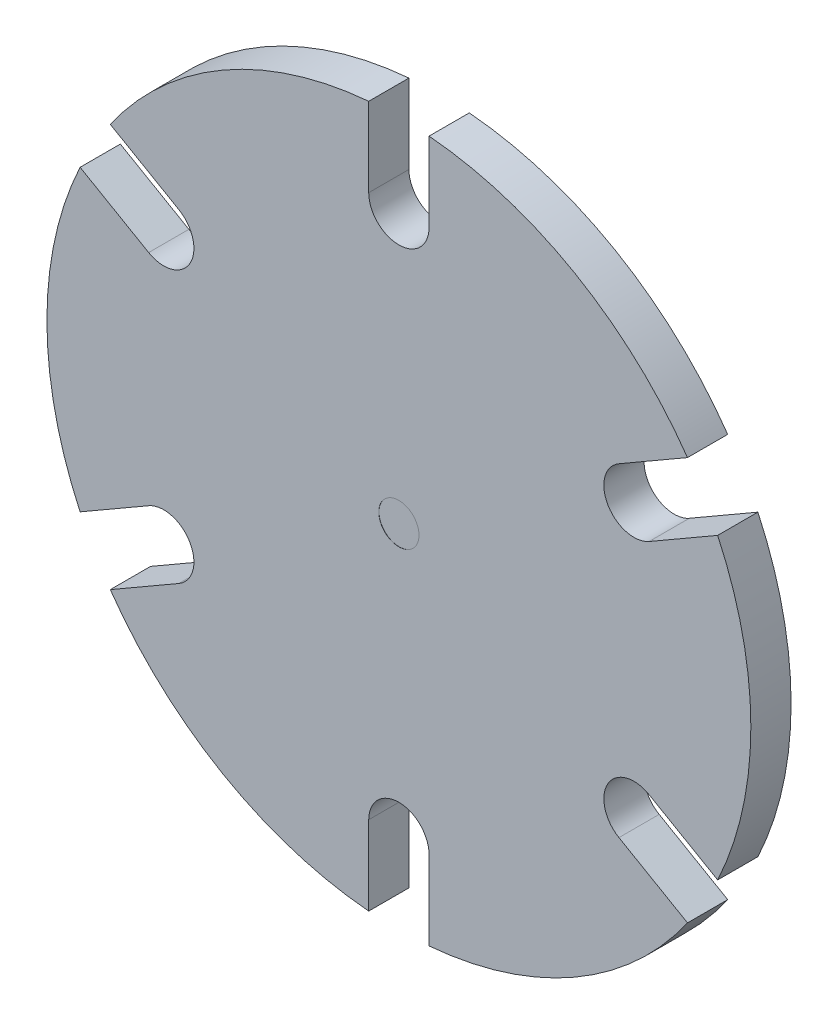
ISO-10303-21;
HEADER;
FILE_DESCRIPTION(('STEP AP214'),'2;1');
FILE_NAME('part.step','',(''),(''),'','','');
FILE_SCHEMA(('AUTOMOTIVE_DESIGN { 1 0 10303 214 1 1 1 1 }'));
ENDSEC;
DATA;
#1=APPLICATION_CONTEXT('core data for automotive mechanical design processes');
#2=APPLICATION_PROTOCOL_DEFINITION('international standard','automotive_design',2000,#1);
#3=PRODUCT_CONTEXT('',#1,'mechanical');
#4=PRODUCT('Part','Part','',(#3));
#5=PRODUCT_RELATED_PRODUCT_CATEGORY('part','',(#4));
#6=PRODUCT_DEFINITION_FORMATION('','',#4);
#7=PRODUCT_DEFINITION_CONTEXT('part definition',#1,'design');
#8=PRODUCT_DEFINITION('design','',#6,#7);
#9=PRODUCT_DEFINITION_SHAPE('','',#8);
#10=(LENGTH_UNIT() NAMED_UNIT(*) SI_UNIT(.MILLI.,.METRE.));
#11=(NAMED_UNIT(*) PLANE_ANGLE_UNIT() SI_UNIT($,.RADIAN.));
#12=(NAMED_UNIT(*) SI_UNIT($,.STERADIAN.) SOLID_ANGLE_UNIT());
#13=UNCERTAINTY_MEASURE_WITH_UNIT(LENGTH_MEASURE(1.E-05),#10,'distance_accuracy_value','');
#14=(GEOMETRIC_REPRESENTATION_CONTEXT(3) GLOBAL_UNCERTAINTY_ASSIGNED_CONTEXT((#13)) GLOBAL_UNIT_ASSIGNED_CONTEXT((#10,
#11,#12)) REPRESENTATION_CONTEXT('',''));
#15=CARTESIAN_POINT('',(0.,0.,0.));
#16=DIRECTION('',(0.,0.,1.));
#17=DIRECTION('',(1.,0.,0.));
#18=AXIS2_PLACEMENT_3D('',#15,#16,#17);
#19=CARTESIAN_POINT('',(0.,0.,2.));
#20=DIRECTION('',(0.,0.,-1.));
#21=DIRECTION('',(-1.,0.,0.));
#22=AXIS2_PLACEMENT_3D('',#19,#20,#21);
#23=CYLINDRICAL_SURFACE('',#22,17.5);
#24=CARTESIAN_POINT('',(0.,0.,2.));
#25=DIRECTION('',(0.,0.,1.));
#26=DIRECTION('',(1.,0.,0.));
#27=AXIS2_PLACEMENT_3D('',#24,#25,#26);
#28=CIRCLE('',#27,17.5);
#29=CARTESIAN_POINT('',(-14.3496688705415,-10.0168359927581,2.));
#30=VERTEX_POINT('',#29);
#31=CARTESIAN_POINT('',(-1.5,-17.4355957741627,2.));
#32=VERTEX_POINT('',#31);
#33=EDGE_CURVE('E458',#30,#32,#28,.T.);
#34=ORIENTED_EDGE('',*,*,#33,.F.);
#35=DIRECTION('',(0.,0.,-1.));
#36=VECTOR('',#35,1.);
#37=CARTESIAN_POINT('',(-14.3496688705415,-10.0168359927581,2.));
#38=LINE('',#37,#36);
#39=CARTESIAN_POINT('',(-14.3496688705415,-10.0168359927581,0.));
#40=VERTEX_POINT('',#39);
#41=EDGE_CURVE('E276',#30,#40,#38,.T.);
#42=ORIENTED_EDGE('',*,*,#41,.T.);
#43=CARTESIAN_POINT('',(0.,0.,0.));
#44=DIRECTION('',(0.,0.,1.));
#45=DIRECTION('',(1.,0.,0.));
#46=AXIS2_PLACEMENT_3D('',#43,#44,#45);
#47=CIRCLE('',#46,17.5);
#48=CARTESIAN_POINT('',(-1.5,-17.4355957741627,0.));
#49=VERTEX_POINT('',#48);
#50=EDGE_CURVE('E450',#40,#49,#47,.T.);
#51=ORIENTED_EDGE('',*,*,#50,.T.);
#52=DIRECTION('',(0.,0.,-1.));
#53=VECTOR('',#52,1.);
#54=CARTESIAN_POINT('',(-1.5,-17.4355957741627,2.));
#55=LINE('',#54,#53);
#56=EDGE_CURVE('E268',#49,#32,#55,.F.);
#57=ORIENTED_EDGE('',*,*,#56,.T.);
#58=EDGE_LOOP('',(#34,#42,#51,#57));
#59=FACE_BOUND('',#58,.T.);
#60=ADVANCED_FACE('F33',(#59),#23,.T.);
#61=CARTESIAN_POINT('',(1.5,-17.4355957741627,2.));
#62=VERTEX_POINT('',#61);
#63=CARTESIAN_POINT('',(14.3496688705416,-10.0168359927579,2.));
#64=VERTEX_POINT('',#63);
#65=EDGE_CURVE('E459',#62,#64,#28,.T.);
#66=ORIENTED_EDGE('',*,*,#65,.F.);
#67=DIRECTION('',(0.,0.,-1.));
#68=VECTOR('',#67,1.);
#69=CARTESIAN_POINT('',(1.5,-17.4355957741627,2.));
#70=LINE('',#69,#68);
#71=CARTESIAN_POINT('',(1.5,-17.4355957741627,0.));
#72=VERTEX_POINT('',#71);
#73=EDGE_CURVE('E271',#62,#72,#70,.T.);
#74=ORIENTED_EDGE('',*,*,#73,.T.);
#75=CARTESIAN_POINT('',(14.3496688705416,-10.0168359927579,0.));
#76=VERTEX_POINT('',#75);
#77=EDGE_CURVE('E446',#72,#76,#47,.T.);
#78=ORIENTED_EDGE('',*,*,#77,.T.);
#79=DIRECTION('',(0.,0.,-1.));
#80=VECTOR('',#79,1.);
#81=CARTESIAN_POINT('',(14.3496688705416,-10.0168359927579,2.));
#82=LINE('',#81,#80);
#83=EDGE_CURVE('E56',#76,#64,#82,.F.);
#84=ORIENTED_EDGE('',*,*,#83,.T.);
#85=EDGE_LOOP('',(#66,#74,#78,#84));
#86=FACE_BOUND('',#85,.T.);
#87=ADVANCED_FACE('F396',(#86),#23,.T.);
#88=CARTESIAN_POINT('',(15.8496688705416,-7.41875978140454,2.));
#89=VERTEX_POINT('',#88);
#90=CARTESIAN_POINT('',(15.8496688705414,7.41875978140488,2.));
#91=VERTEX_POINT('',#90);
#92=EDGE_CURVE('E461',#89,#91,#28,.T.);
#93=ORIENTED_EDGE('',*,*,#92,.F.);
#94=DIRECTION('',(0.,0.,-1.));
#95=VECTOR('',#94,1.);
#96=CARTESIAN_POINT('',(15.8496688705416,-7.41875978140454,2.));
#97=LINE('',#96,#95);
#98=CARTESIAN_POINT('',(15.8496688705416,-7.41875978140455,0.));
#99=VERTEX_POINT('',#98);
#100=EDGE_CURVE('E265',#89,#99,#97,.T.);
#101=ORIENTED_EDGE('',*,*,#100,.T.);
#102=CARTESIAN_POINT('',(15.8496688705414,7.41875978140488,0.));
#103=VERTEX_POINT('',#102);
#104=EDGE_CURVE('E444',#99,#103,#47,.T.);
#105=ORIENTED_EDGE('',*,*,#104,.T.);
#106=DIRECTION('',(0.,0.,-1.));
#107=VECTOR('',#106,1.);
#108=CARTESIAN_POINT('',(15.8496688705414,7.41875978140488,2.));
#109=LINE('',#108,#107);
#110=EDGE_CURVE('E48',#103,#91,#109,.F.);
#111=ORIENTED_EDGE('',*,*,#110,.T.);
#112=EDGE_LOOP('',(#93,#101,#105,#111));
#113=FACE_BOUND('',#112,.T.);
#114=ADVANCED_FACE('F402',(#113),#23,.T.);
#115=CARTESIAN_POINT('',(14.3496688705414,10.0168359927582,2.));
#116=VERTEX_POINT('',#115);
#117=CARTESIAN_POINT('',(1.5,17.4355957741627,2.));
#118=VERTEX_POINT('',#117);
#119=EDGE_CURVE('E327',#116,#118,#28,.T.);
#120=ORIENTED_EDGE('',*,*,#119,.F.);
#121=DIRECTION('',(0.,0.,-1.));
#122=VECTOR('',#121,1.);
#123=CARTESIAN_POINT('',(14.3496688705414,10.0168359927582,2.));
#124=LINE('',#123,#122);
#125=CARTESIAN_POINT('',(14.3496688705414,10.0168359927582,0.));
#126=VERTEX_POINT('',#125);
#127=EDGE_CURVE('E261',#116,#126,#124,.T.);
#128=ORIENTED_EDGE('',*,*,#127,.T.);
#129=CARTESIAN_POINT('',(1.5,17.4355957741627,0.));
#130=VERTEX_POINT('',#129);
#131=EDGE_CURVE('E322',#126,#130,#47,.T.);
#132=ORIENTED_EDGE('',*,*,#131,.T.);
#133=DIRECTION('',(0.,0.,-1.));
#134=VECTOR('',#133,1.);
#135=CARTESIAN_POINT('',(1.5,17.4355957741627,2.));
#136=LINE('',#135,#134);
#137=EDGE_CURVE('E315',#130,#118,#136,.F.);
#138=ORIENTED_EDGE('',*,*,#137,.T.);
#139=EDGE_LOOP('',(#120,#128,#132,#138));
#140=FACE_BOUND('',#139,.T.);
#141=ADVANCED_FACE('F415',(#140),#23,.T.);
#142=CARTESIAN_POINT('',(-15.8496688705415,7.41875978140466,0.));
#143=VERTEX_POINT('',#142);
#144=CARTESIAN_POINT('',(-15.8496688705415,-7.41875978140477,0.));
#145=VERTEX_POINT('',#144);
#146=EDGE_CURVE('E331',#143,#145,#47,.T.);
#147=ORIENTED_EDGE('',*,*,#146,.T.);
#148=DIRECTION('',(0.,0.,-1.));
#149=VECTOR('',#148,1.);
#150=CARTESIAN_POINT('',(-15.8496688705415,-7.41875978140477,2.));
#151=LINE('',#150,#149);
#152=CARTESIAN_POINT('',(-15.8496688705415,-7.41875978140477,2.));
#153=VERTEX_POINT('',#152);
#154=EDGE_CURVE('E274',#145,#153,#151,.F.);
#155=ORIENTED_EDGE('',*,*,#154,.T.);
#156=CARTESIAN_POINT('',(-15.8496688705415,7.41875978140466,2.));
#157=VERTEX_POINT('',#156);
#158=EDGE_CURVE('E220',#157,#153,#28,.T.);
#159=ORIENTED_EDGE('',*,*,#158,.F.);
#160=DIRECTION('',(0.,0.,-1.));
#161=VECTOR('',#160,1.);
#162=CARTESIAN_POINT('',(-15.8496688705415,7.41875978140466,2.));
#163=LINE('',#162,#161);
#164=EDGE_CURVE('E294',#157,#143,#163,.T.);
#165=ORIENTED_EDGE('',*,*,#164,.T.);
#166=EDGE_LOOP('',(#147,#155,#159,#165));
#167=FACE_BOUND('',#166,.T.);
#168=ADVANCED_FACE('F407',(#167),#23,.T.);
#169=CARTESIAN_POINT('',(-1.5,17.4355957741627,0.));
#170=VERTEX_POINT('',#169);
#171=CARTESIAN_POINT('',(-14.3496688705415,10.016835992758,0.));
#172=VERTEX_POINT('',#171);
#173=EDGE_CURVE('E328',#170,#172,#47,.T.);
#174=ORIENTED_EDGE('',*,*,#173,.T.);
#175=DIRECTION('',(0.,0.,-1.));
#176=VECTOR('',#175,1.);
#177=CARTESIAN_POINT('',(-14.3496688705415,10.016835992758,2.));
#178=LINE('',#177,#176);
#179=CARTESIAN_POINT('',(-14.3496688705415,10.016835992758,2.));
#180=VERTEX_POINT('',#179);
#181=EDGE_CURVE('E290',#172,#180,#178,.F.);
#182=ORIENTED_EDGE('',*,*,#181,.T.);
#183=CARTESIAN_POINT('',(-1.5,17.4355957741627,2.));
#184=VERTEX_POINT('',#183);
#185=EDGE_CURVE('E323',#184,#180,#28,.T.);
#186=ORIENTED_EDGE('',*,*,#185,.F.);
#187=DIRECTION('',(0.,0.,-1.));
#188=VECTOR('',#187,1.);
#189=CARTESIAN_POINT('',(-1.5,17.4355957741627,2.));
#190=LINE('',#189,#188);
#191=EDGE_CURVE('E319',#184,#170,#190,.T.);
#192=ORIENTED_EDGE('',*,*,#191,.T.);
#193=EDGE_LOOP('',(#174,#182,#186,#192));
#194=FACE_BOUND('',#193,.T.);
#195=ADVANCED_FACE('F398',(#194),#23,.T.);
#196=CARTESIAN_POINT('',(0.,0.,2.));
#197=DIRECTION('',(0.,0.,1.));
#198=DIRECTION('',(1.,0.,0.));
#199=AXIS2_PLACEMENT_3D('',#196,#197,#198);
#200=PLANE('',#199);
#201=DIRECTION('',(0.866025403784436,0.500000000000004,0.));
#202=VECTOR('',#201,1.);
#203=CARTESIAN_POINT('',(-10.9413429510899,-8.04903810567671,2.));
#204=LINE('',#203,#202);
#205=CARTESIAN_POINT('',(-10.9413429510899,-8.04903810567671,2.));
#206=VERTEX_POINT('',#205);
#207=EDGE_CURVE('E204',#30,#206,#204,.T.);
#208=ORIENTED_EDGE('',*,*,#207,.F.);
#209=ORIENTED_EDGE('',*,*,#33,.T.);
#210=DIRECTION('',(0.,-1.,0.));
#211=VECTOR('',#210,1.);
#212=CARTESIAN_POINT('',(-1.5,-13.5,2.));
#213=LINE('',#212,#211);
#214=CARTESIAN_POINT('',(-1.5,-13.5,2.));
#215=VERTEX_POINT('',#214);
#216=EDGE_CURVE('E228',#215,#32,#213,.T.);
#217=ORIENTED_EDGE('',*,*,#216,.F.);
#218=CARTESIAN_POINT('',(0.,-13.5,2.));
#219=DIRECTION('',(0.,0.,1.));
#220=DIRECTION('',(-1.,0.,0.));
#221=AXIS2_PLACEMENT_3D('',#218,#219,#220);
#222=CIRCLE('',#221,1.5);
#223=CARTESIAN_POINT('',(1.5,-13.5,2.));
#224=VERTEX_POINT('',#223);
#225=EDGE_CURVE('E225',#224,#215,#222,.T.);
#226=ORIENTED_EDGE('',*,*,#225,.F.);
#227=DIRECTION('',(0.,1.,0.));
#228=VECTOR('',#227,1.);
#229=CARTESIAN_POINT('',(1.5,-13.5,2.));
#230=LINE('',#229,#228);
#231=EDGE_CURVE('E231',#62,#224,#230,.T.);
#232=ORIENTED_EDGE('',*,*,#231,.F.);
#233=ORIENTED_EDGE('',*,*,#65,.T.);
#234=DIRECTION('',(0.866025403784443,-0.499999999999992,0.));
#235=VECTOR('',#234,1.);
#236=CARTESIAN_POINT('',(10.94134295109,-8.04903810567656,2.));
#237=LINE('',#236,#235);
#238=CARTESIAN_POINT('',(10.94134295109,-8.04903810567656,2.));
#239=VERTEX_POINT('',#238);
#240=EDGE_CURVE('E240',#239,#64,#237,.T.);
#241=ORIENTED_EDGE('',*,*,#240,.F.);
#242=CARTESIAN_POINT('',(11.69134295109,-6.74999999999989,2.));
#243=DIRECTION('',(0.,0.,1.));
#244=DIRECTION('',(-0.499999999999992,-0.866025403784443,0.));
#245=AXIS2_PLACEMENT_3D('',#242,#243,#244);
#246=CIRCLE('',#245,1.5);
#247=CARTESIAN_POINT('',(12.44134295109,-5.45096189432323,2.));
#248=VERTEX_POINT('',#247);
#249=EDGE_CURVE('E237',#248,#239,#246,.T.);
#250=ORIENTED_EDGE('',*,*,#249,.F.);
#251=DIRECTION('',(-0.866025403784443,0.499999999999992,0.));
#252=VECTOR('',#251,1.);
#253=CARTESIAN_POINT('',(12.44134295109,-5.45096189432323,2.));
#254=LINE('',#253,#252);
#255=EDGE_CURVE('E243',#89,#248,#254,.T.);
#256=ORIENTED_EDGE('',*,*,#255,.F.);
#257=ORIENTED_EDGE('',*,*,#92,.T.);
#258=DIRECTION('',(0.866025403784433,0.50000000000001,0.));
#259=VECTOR('',#258,1.);
#260=CARTESIAN_POINT('',(12.4413429510899,5.45096189432349,2.));
#261=LINE('',#260,#259);
#262=CARTESIAN_POINT('',(12.4413429510899,5.45096189432349,2.));
#263=VERTEX_POINT('',#262);
#264=EDGE_CURVE('E252',#263,#91,#261,.T.);
#265=ORIENTED_EDGE('',*,*,#264,.F.);
#266=CARTESIAN_POINT('',(11.6913429510898,6.75000000000014,2.));
#267=DIRECTION('',(0.,0.,1.));
#268=DIRECTION('',(0.50000000000001,-0.866025403784433,0.));
#269=AXIS2_PLACEMENT_3D('',#266,#267,#268);
#270=CIRCLE('',#269,1.5);
#271=CARTESIAN_POINT('',(10.9413429510898,8.04903810567679,2.));
#272=VERTEX_POINT('',#271);
#273=EDGE_CURVE('E249',#272,#263,#270,.T.);
#274=ORIENTED_EDGE('',*,*,#273,.F.);
#275=DIRECTION('',(-0.866025403784433,-0.50000000000001,0.));
#276=VECTOR('',#275,1.);
#277=CARTESIAN_POINT('',(10.9413429510898,8.04903810567679,2.));
#278=LINE('',#277,#276);
#279=EDGE_CURVE('E254',#116,#272,#278,.T.);
#280=ORIENTED_EDGE('',*,*,#279,.F.);
#281=ORIENTED_EDGE('',*,*,#119,.T.);
#282=DIRECTION('',(0.,1.,0.));
#283=VECTOR('',#282,1.);
#284=CARTESIAN_POINT('',(1.5,13.5,2.));
#285=LINE('',#284,#283);
#286=CARTESIAN_POINT('',(1.5,13.5,2.));
#287=VERTEX_POINT('',#286);
#288=EDGE_CURVE('E306',#287,#118,#285,.T.);
#289=ORIENTED_EDGE('',*,*,#288,.F.);
#290=CARTESIAN_POINT('',(0.,13.5,2.));
#291=DIRECTION('',(0.,0.,1.));
#292=DIRECTION('',(1.,0.,0.));
#293=AXIS2_PLACEMENT_3D('',#290,#291,#292);
#294=CIRCLE('',#293,1.5);
#295=CARTESIAN_POINT('',(-1.5,13.5,2.));
#296=VERTEX_POINT('',#295);
#297=EDGE_CURVE('E301',#296,#287,#294,.T.);
#298=ORIENTED_EDGE('',*,*,#297,.F.);
#299=DIRECTION('',(0.,-1.,0.));
#300=VECTOR('',#299,1.);
#301=CARTESIAN_POINT('',(-1.5,13.5,2.));
#302=LINE('',#301,#300);
#303=EDGE_CURVE('E309',#184,#296,#302,.T.);
#304=ORIENTED_EDGE('',*,*,#303,.F.);
#305=ORIENTED_EDGE('',*,*,#185,.T.);
#306=DIRECTION('',(-0.86602540378444,0.499999999999998,0.));
#307=VECTOR('',#306,1.);
#308=CARTESIAN_POINT('',(-10.9413429510899,8.04903810567663,2.));
#309=LINE('',#308,#307);
#310=CARTESIAN_POINT('',(-10.9413429510899,8.04903810567663,2.));
#311=VERTEX_POINT('',#310);
#312=EDGE_CURVE('E282',#311,#180,#309,.T.);
#313=ORIENTED_EDGE('',*,*,#312,.F.);
#314=CARTESIAN_POINT('',(-11.6913429510899,6.74999999999998,2.));
#315=DIRECTION('',(0.,0.,1.));
#316=DIRECTION('',(0.499999999999998,0.86602540378444,0.));
#317=AXIS2_PLACEMENT_3D('',#314,#315,#316);
#318=CIRCLE('',#317,1.5);
#319=CARTESIAN_POINT('',(-12.4413429510899,5.45096189432331,2.));
#320=VERTEX_POINT('',#319);
#321=EDGE_CURVE('E279',#320,#311,#318,.T.);
#322=ORIENTED_EDGE('',*,*,#321,.F.);
#323=DIRECTION('',(0.86602540378444,-0.499999999999998,0.));
#324=VECTOR('',#323,1.);
#325=CARTESIAN_POINT('',(-12.4413429510899,5.45096189432331,2.));
#326=LINE('',#325,#324);
#327=EDGE_CURVE('E284',#157,#320,#326,.T.);
#328=ORIENTED_EDGE('',*,*,#327,.F.);
#329=ORIENTED_EDGE('',*,*,#158,.T.);
#330=DIRECTION('',(-0.866025403784436,-0.500000000000004,0.));
#331=VECTOR('',#330,1.);
#332=CARTESIAN_POINT('',(-12.4413429510899,-5.4509618943234,2.));
#333=LINE('',#332,#331);
#334=CARTESIAN_POINT('',(-12.4413429510899,-5.4509618943234,2.));
#335=VERTEX_POINT('',#334);
#336=EDGE_CURVE('E197',#335,#153,#333,.T.);
#337=ORIENTED_EDGE('',*,*,#336,.F.);
#338=CARTESIAN_POINT('',(-11.6913429510899,-6.75000000000006,2.));
#339=DIRECTION('',(0.,0.,1.));
#340=DIRECTION('',(-0.500000000000004,0.866025403784436,0.));
#341=AXIS2_PLACEMENT_3D('',#338,#339,#340);
#342=CIRCLE('',#341,1.5);
#343=EDGE_CURVE('E207',#206,#335,#342,.T.);
#344=ORIENTED_EDGE('',*,*,#343,.F.);
#345=EDGE_LOOP('',(#208,#209,#217,#226,#232,#233,#241,#250,#256,#257,#265,#274,#280,#281,#289,
#298,#304,#305,#313,#322,#328,#329,#337,#344));
#346=FACE_BOUND('',#345,.T.);
#347=CARTESIAN_POINT('',(0.,0.,2.));
#348=DIRECTION('',(0.,0.,1.));
#349=DIRECTION('',(1.,0.,0.));
#350=AXIS2_PLACEMENT_3D('',#347,#348,#349);
#351=CIRCLE('',#350,1.);
#352=CARTESIAN_POINT('',(1.,0.,2.));
#353=VERTEX_POINT('',#352);
#354=EDGE_CURVE('E297',#353,#353,#351,.T.);
#355=ORIENTED_EDGE('',*,*,#354,.F.);
#356=EDGE_LOOP('',(#355));
#357=FACE_BOUND('',#356,.T.);
#358=ADVANCED_FACE('F216',(#346,#357),#200,.T.);
#359=CARTESIAN_POINT('',(0.,0.,0.));
#360=DIRECTION('',(0.,0.,1.));
#361=DIRECTION('',(1.,0.,0.));
#362=AXIS2_PLACEMENT_3D('',#359,#360,#361);
#363=PLANE('',#362);
#364=CARTESIAN_POINT('',(0.,0.,0.));
#365=DIRECTION('',(0.,0.,1.));
#366=DIRECTION('',(1.,0.,0.));
#367=AXIS2_PLACEMENT_3D('',#364,#365,#366);
#368=CIRCLE('',#367,10.);
#369=CARTESIAN_POINT('',(10.,0.,0.));
#370=VERTEX_POINT('',#369);
#371=EDGE_CURVE('E326',#370,#370,#368,.F.);
#372=ORIENTED_EDGE('',*,*,#371,.F.);
#373=EDGE_LOOP('',(#372));
#374=FACE_BOUND('',#373,.T.);
#375=ORIENTED_EDGE('',*,*,#50,.F.);
#376=DIRECTION('',(0.866025403784436,0.500000000000004,0.));
#377=VECTOR('',#376,1.);
#378=CARTESIAN_POINT('',(0.750000000000006,-1.29903810567665,0.));
#379=LINE('',#378,#377);
#380=CARTESIAN_POINT('',(-10.9413429510899,-8.04903810567671,0.));
#381=VERTEX_POINT('',#380);
#382=EDGE_CURVE('E380',#40,#381,#379,.T.);
#383=ORIENTED_EDGE('',*,*,#382,.T.);
#384=CARTESIAN_POINT('',(-11.6913429510899,-6.75000000000006,0.));
#385=DIRECTION('',(0.,0.,1.));
#386=DIRECTION('',(1.,0.,0.));
#387=AXIS2_PLACEMENT_3D('',#384,#385,#386);
#388=CIRCLE('',#387,1.5);
#389=CARTESIAN_POINT('',(-12.4413429510899,-5.4509618943234,0.));
#390=VERTEX_POINT('',#389);
#391=EDGE_CURVE('E378',#381,#390,#388,.T.);
#392=ORIENTED_EDGE('',*,*,#391,.T.);
#393=DIRECTION('',(-0.866025403784436,-0.500000000000004,0.));
#394=VECTOR('',#393,1.);
#395=CARTESIAN_POINT('',(-0.750000000000006,1.29903810567665,0.));
#396=LINE('',#395,#394);
#397=EDGE_CURVE('E200',#390,#145,#396,.T.);
#398=ORIENTED_EDGE('',*,*,#397,.T.);
#399=ORIENTED_EDGE('',*,*,#146,.F.);
#400=DIRECTION('',(0.86602540378444,-0.499999999999998,0.));
#401=VECTOR('',#400,1.);
#402=CARTESIAN_POINT('',(-0.749999999999997,-1.29903810567666,0.));
#403=LINE('',#402,#401);
#404=CARTESIAN_POINT('',(-12.4413429510899,5.45096189432331,0.));
#405=VERTEX_POINT('',#404);
#406=EDGE_CURVE('E349',#143,#405,#403,.T.);
#407=ORIENTED_EDGE('',*,*,#406,.T.);
#408=CARTESIAN_POINT('',(-11.6913429510899,6.74999999999998,0.));
#409=DIRECTION('',(0.,0.,1.));
#410=DIRECTION('',(1.,0.,0.));
#411=AXIS2_PLACEMENT_3D('',#408,#409,#410);
#412=CIRCLE('',#411,1.5);
#413=CARTESIAN_POINT('',(-10.9413429510899,8.04903810567663,0.));
#414=VERTEX_POINT('',#413);
#415=EDGE_CURVE('E346',#405,#414,#412,.T.);
#416=ORIENTED_EDGE('',*,*,#415,.T.);
#417=DIRECTION('',(-0.86602540378444,0.499999999999998,0.));
#418=VECTOR('',#417,1.);
#419=CARTESIAN_POINT('',(0.749999999999998,1.29903810567666,0.));
#420=LINE('',#419,#418);
#421=EDGE_CURVE('E343',#414,#172,#420,.T.);
#422=ORIENTED_EDGE('',*,*,#421,.T.);
#423=ORIENTED_EDGE('',*,*,#173,.F.);
#424=DIRECTION('',(0.,-1.,0.));
#425=VECTOR('',#424,1.);
#426=CARTESIAN_POINT('',(-1.5,0.,0.));
#427=LINE('',#426,#425);
#428=CARTESIAN_POINT('',(-1.5,13.5,0.));
#429=VERTEX_POINT('',#428);
#430=EDGE_CURVE('E340',#170,#429,#427,.T.);
#431=ORIENTED_EDGE('',*,*,#430,.T.);
#432=CARTESIAN_POINT('',(0.,13.5,0.));
#433=DIRECTION('',(0.,0.,1.));
#434=DIRECTION('',(1.,0.,0.));
#435=AXIS2_PLACEMENT_3D('',#432,#433,#434);
#436=CIRCLE('',#435,1.5);
#437=CARTESIAN_POINT('',(1.5,13.5,0.));
#438=VERTEX_POINT('',#437);
#439=EDGE_CURVE('E337',#429,#438,#436,.T.);
#440=ORIENTED_EDGE('',*,*,#439,.T.);
#441=DIRECTION('',(0.,1.,0.));
#442=VECTOR('',#441,1.);
#443=CARTESIAN_POINT('',(1.5,0.,0.));
#444=LINE('',#443,#442);
#445=EDGE_CURVE('E334',#438,#130,#444,.T.);
#446=ORIENTED_EDGE('',*,*,#445,.T.);
#447=ORIENTED_EDGE('',*,*,#131,.F.);
#448=DIRECTION('',(-0.866025403784433,-0.50000000000001,0.));
#449=VECTOR('',#448,1.);
#450=CARTESIAN_POINT('',(-0.750000000000015,1.29903810567665,0.));
#451=LINE('',#450,#449);
#452=CARTESIAN_POINT('',(10.9413429510898,8.04903810567679,0.));
#453=VERTEX_POINT('',#452);
#454=EDGE_CURVE('E357',#126,#453,#451,.T.);
#455=ORIENTED_EDGE('',*,*,#454,.T.);
#456=CARTESIAN_POINT('',(11.6913429510898,6.75000000000014,0.));
#457=DIRECTION('',(0.,0.,1.));
#458=DIRECTION('',(1.,0.,0.));
#459=AXIS2_PLACEMENT_3D('',#456,#457,#458);
#460=CIRCLE('',#459,1.5);
#461=CARTESIAN_POINT('',(12.4413429510899,5.45096189432349,0.));
#462=VERTEX_POINT('',#461);
#463=EDGE_CURVE('E354',#453,#462,#460,.T.);
#464=ORIENTED_EDGE('',*,*,#463,.T.);
#465=DIRECTION('',(0.866025403784433,0.50000000000001,0.));
#466=VECTOR('',#465,1.);
#467=CARTESIAN_POINT('',(0.750000000000015,-1.29903810567665,0.));
#468=LINE('',#467,#466);
#469=EDGE_CURVE('E352',#462,#103,#468,.T.);
#470=ORIENTED_EDGE('',*,*,#469,.T.);
#471=ORIENTED_EDGE('',*,*,#104,.F.);
#472=DIRECTION('',(-0.866025403784443,0.499999999999992,0.));
#473=VECTOR('',#472,1.);
#474=CARTESIAN_POINT('',(0.749999999999988,1.29903810567667,0.));
#475=LINE('',#474,#473);
#476=CARTESIAN_POINT('',(12.44134295109,-5.45096189432323,0.));
#477=VERTEX_POINT('',#476);
#478=EDGE_CURVE('E365',#99,#477,#475,.T.);
#479=ORIENTED_EDGE('',*,*,#478,.T.);
#480=CARTESIAN_POINT('',(11.69134295109,-6.74999999999989,0.));
#481=DIRECTION('',(0.,0.,1.));
#482=DIRECTION('',(1.,0.,0.));
#483=AXIS2_PLACEMENT_3D('',#480,#481,#482);
#484=CIRCLE('',#483,1.5);
#485=CARTESIAN_POINT('',(10.94134295109,-8.04903810567656,0.));
#486=VERTEX_POINT('',#485);
#487=EDGE_CURVE('E362',#477,#486,#484,.T.);
#488=ORIENTED_EDGE('',*,*,#487,.T.);
#489=DIRECTION('',(0.866025403784443,-0.499999999999992,0.));
#490=VECTOR('',#489,1.);
#491=CARTESIAN_POINT('',(-0.749999999999989,-1.29903810567667,0.));
#492=LINE('',#491,#490);
#493=EDGE_CURVE('E360',#486,#76,#492,.T.);
#494=ORIENTED_EDGE('',*,*,#493,.T.);
#495=ORIENTED_EDGE('',*,*,#77,.F.);
#496=DIRECTION('',(0.,1.,0.));
#497=VECTOR('',#496,1.);
#498=CARTESIAN_POINT('',(1.5,0.,0.));
#499=LINE('',#498,#497);
#500=CARTESIAN_POINT('',(1.5,-13.5,0.));
#501=VERTEX_POINT('',#500);
#502=EDGE_CURVE('E374',#72,#501,#499,.T.);
#503=ORIENTED_EDGE('',*,*,#502,.T.);
#504=CARTESIAN_POINT('',(0.,-13.5,0.));
#505=DIRECTION('',(0.,0.,1.));
#506=DIRECTION('',(1.,0.,0.));
#507=AXIS2_PLACEMENT_3D('',#504,#505,#506);
#508=CIRCLE('',#507,1.5);
#509=CARTESIAN_POINT('',(-1.5,-13.5,0.));
#510=VERTEX_POINT('',#509);
#511=EDGE_CURVE('E371',#501,#510,#508,.T.);
#512=ORIENTED_EDGE('',*,*,#511,.T.);
#513=DIRECTION('',(0.,-1.,0.));
#514=VECTOR('',#513,1.);
#515=CARTESIAN_POINT('',(-1.5,0.,0.));
#516=LINE('',#515,#514);
#517=EDGE_CURVE('E368',#510,#49,#516,.T.);
#518=ORIENTED_EDGE('',*,*,#517,.T.);
#519=EDGE_LOOP('',(#375,#383,#392,#398,#399,#407,#416,#422,#423,#431,#440,#446,#447,#455,#464,
#470,#471,#479,#488,#494,#495,#503,#512,#518));
#520=FACE_BOUND('',#519,.T.);
#521=ADVANCED_FACE('F413',(#374,#520),#363,.F.);
#522=CARTESIAN_POINT('',(0.,0.,-1.));
#523=DIRECTION('',(0.,0.,1.));
#524=DIRECTION('',(1.,0.,0.));
#525=AXIS2_PLACEMENT_3D('',#522,#523,#524);
#526=CYLINDRICAL_SURFACE('',#525,10.);
#527=CARTESIAN_POINT('',(0.,0.,-0.7));
#528=DIRECTION('',(0.,0.,-1.));
#529=DIRECTION('',(-1.,0.,0.));
#530=AXIS2_PLACEMENT_3D('',#527,#528,#529);
#531=CIRCLE('',#530,10.);
#532=CARTESIAN_POINT('',(-10.,0.,-0.7));
#533=VERTEX_POINT('',#532);
#534=EDGE_CURVE('E11',#533,#533,#531,.F.);
#535=ORIENTED_EDGE('',*,*,#534,.T.);
#536=EDGE_LOOP('',(#535));
#537=FACE_BOUND('',#536,.T.);
#538=ORIENTED_EDGE('',*,*,#371,.T.);
#539=EDGE_LOOP('',(#538));
#540=FACE_BOUND('',#539,.T.);
#541=ADVANCED_FACE('F542',(#537,#540),#526,.T.);
#542=CARTESIAN_POINT('',(0.,0.,-1.));
#543=DIRECTION('',(0.,0.,-1.));
#544=DIRECTION('',(-1.,0.,0.));
#545=AXIS2_PLACEMENT_3D('',#542,#543,#544);
#546=PLANE('',#545);
#547=CARTESIAN_POINT('',(0.,0.,-1.));
#548=DIRECTION('',(0.,0.,-1.));
#549=DIRECTION('',(-1.,0.,0.));
#550=AXIS2_PLACEMENT_3D('',#547,#548,#549);
#551=CIRCLE('',#550,9.7);
#552=CARTESIAN_POINT('',(-9.7,0.,-1.));
#553=VERTEX_POINT('',#552);
#554=EDGE_CURVE('E41',#553,#553,#551,.T.);
#555=ORIENTED_EDGE('',*,*,#554,.T.);
#556=EDGE_LOOP('',(#555));
#557=FACE_BOUND('',#556,.T.);
#558=ADVANCED_FACE('F385',(#557),#546,.T.);
#559=CARTESIAN_POINT('',(0.,13.5,-4.));
#560=DIRECTION('',(0.,0.,1.));
#561=DIRECTION('',(1.,0.,0.));
#562=AXIS2_PLACEMENT_3D('',#559,#560,#561);
#563=CYLINDRICAL_SURFACE('',#562,1.5);
#564=DIRECTION('',(0.,0.,1.));
#565=VECTOR('',#564,1.);
#566=CARTESIAN_POINT('',(-1.5,13.5,-4.));
#567=LINE('',#566,#565);
#568=EDGE_CURVE('E313',#429,#296,#567,.T.);
#569=ORIENTED_EDGE('',*,*,#568,.T.);
#570=ORIENTED_EDGE('',*,*,#297,.T.);
#571=DIRECTION('',(0.,0.,1.));
#572=VECTOR('',#571,1.);
#573=CARTESIAN_POINT('',(1.5,13.5,-4.));
#574=LINE('',#573,#572);
#575=EDGE_CURVE('E312',#438,#287,#574,.T.);
#576=ORIENTED_EDGE('',*,*,#575,.F.);
#577=ORIENTED_EDGE('',*,*,#439,.F.);
#578=EDGE_LOOP('',(#569,#570,#576,#577));
#579=FACE_BOUND('',#578,.T.);
#580=ADVANCED_FACE('F436',(#579),#563,.F.);
#581=CARTESIAN_POINT('',(-1.5,13.5,-4.));
#582=DIRECTION('',(-1.,0.,0.));
#583=DIRECTION('',(0.,0.,1.));
#584=AXIS2_PLACEMENT_3D('',#581,#582,#583);
#585=PLANE('',#584);
#586=ORIENTED_EDGE('',*,*,#303,.T.);
#587=ORIENTED_EDGE('',*,*,#568,.F.);
#588=ORIENTED_EDGE('',*,*,#430,.F.);
#589=ORIENTED_EDGE('',*,*,#191,.F.);
#590=EDGE_LOOP('',(#586,#587,#588,#589));
#591=FACE_BOUND('',#590,.T.);
#592=ADVANCED_FACE('F434',(#591),#585,.F.);
#593=CARTESIAN_POINT('',(1.5,13.5,-4.));
#594=DIRECTION('',(1.,0.,0.));
#595=DIRECTION('',(0.,1.,0.));
#596=AXIS2_PLACEMENT_3D('',#593,#594,#595);
#597=PLANE('',#596);
#598=ORIENTED_EDGE('',*,*,#445,.F.);
#599=ORIENTED_EDGE('',*,*,#575,.T.);
#600=ORIENTED_EDGE('',*,*,#288,.T.);
#601=ORIENTED_EDGE('',*,*,#137,.F.);
#602=EDGE_LOOP('',(#598,#599,#600,#601));
#603=FACE_BOUND('',#602,.T.);
#604=ADVANCED_FACE('F441',(#603),#597,.F.);
#605=CARTESIAN_POINT('',(0.,0.,1.99));
#606=DIRECTION('',(0.,0.,1.));
#607=DIRECTION('',(1.,0.,0.));
#608=AXIS2_PLACEMENT_3D('',#605,#606,#607);
#609=CYLINDRICAL_SURFACE('',#608,1.);
#610=CARTESIAN_POINT('',(0.,0.,1.99));
#611=DIRECTION('',(0.,0.,1.));
#612=DIRECTION('',(1.,0.,0.));
#613=AXIS2_PLACEMENT_3D('',#610,#611,#612);
#614=CIRCLE('',#613,1.);
#615=CARTESIAN_POINT('',(1.,0.,1.99));
#616=VERTEX_POINT('',#615);
#617=EDGE_CURVE('E298',#616,#616,#614,.T.);
#618=ORIENTED_EDGE('',*,*,#617,.F.);
#619=EDGE_LOOP('',(#618));
#620=FACE_BOUND('',#619,.T.);
#621=ORIENTED_EDGE('',*,*,#354,.T.);
#622=EDGE_LOOP('',(#621));
#623=FACE_BOUND('',#622,.T.);
#624=ADVANCED_FACE('F529',(#620,#623),#609,.F.);
#625=CARTESIAN_POINT('',(0.,0.,1.99));
#626=DIRECTION('',(0.,0.,1.));
#627=DIRECTION('',(1.,0.,0.));
#628=AXIS2_PLACEMENT_3D('',#625,#626,#627);
#629=PLANE('',#628);
#630=ORIENTED_EDGE('',*,*,#617,.T.);
#631=EDGE_LOOP('',(#630));
#632=FACE_BOUND('',#631,.T.);
#633=ADVANCED_FACE('F526',(#632),#629,.T.);
#634=CARTESIAN_POINT('',(-11.6913429510899,6.74999999999998,-4.));
#635=DIRECTION('',(0.,0.,1.));
#636=DIRECTION('',(1.,0.,0.));
#637=AXIS2_PLACEMENT_3D('',#634,#635,#636);
#638=CYLINDRICAL_SURFACE('',#637,1.5);
#639=DIRECTION('',(0.,0.,1.));
#640=VECTOR('',#639,1.);
#641=CARTESIAN_POINT('',(-12.4413429510899,5.45096189432331,-4.));
#642=LINE('',#641,#640);
#643=EDGE_CURVE('E288',#405,#320,#642,.T.);
#644=ORIENTED_EDGE('',*,*,#643,.T.);
#645=ORIENTED_EDGE('',*,*,#321,.T.);
#646=DIRECTION('',(0.,0.,1.));
#647=VECTOR('',#646,1.);
#648=CARTESIAN_POINT('',(-10.9413429510899,8.04903810567663,-4.));
#649=LINE('',#648,#647);
#650=EDGE_CURVE('E287',#414,#311,#649,.T.);
#651=ORIENTED_EDGE('',*,*,#650,.F.);
#652=ORIENTED_EDGE('',*,*,#415,.F.);
#653=EDGE_LOOP('',(#644,#645,#651,#652));
#654=FACE_BOUND('',#653,.T.);
#655=ADVANCED_FACE('F425',(#654),#638,.F.);
#656=CARTESIAN_POINT('',(-12.4413429510899,5.45096189432331,-4.));
#657=DIRECTION('',(-0.499999999999998,-0.86602540378444,0.));
#658=DIRECTION('',(0.86602540378444,-0.499999999999998,0.));
#659=AXIS2_PLACEMENT_3D('',#656,#657,#658);
#660=PLANE('',#659);
#661=ORIENTED_EDGE('',*,*,#327,.T.);
#662=ORIENTED_EDGE('',*,*,#643,.F.);
#663=ORIENTED_EDGE('',*,*,#406,.F.);
#664=ORIENTED_EDGE('',*,*,#164,.F.);
#665=EDGE_LOOP('',(#661,#662,#663,#664));
#666=FACE_BOUND('',#665,.T.);
#667=ADVANCED_FACE('F518',(#666),#660,.F.);
#668=CARTESIAN_POINT('',(-10.9413429510899,8.04903810567663,-4.));
#669=DIRECTION('',(0.499999999999998,0.86602540378444,0.));
#670=DIRECTION('',(-0.86602540378444,0.499999999999998,0.));
#671=AXIS2_PLACEMENT_3D('',#668,#669,#670);
#672=PLANE('',#671);
#673=ORIENTED_EDGE('',*,*,#421,.F.);
#674=ORIENTED_EDGE('',*,*,#650,.T.);
#675=ORIENTED_EDGE('',*,*,#312,.T.);
#676=ORIENTED_EDGE('',*,*,#181,.F.);
#677=EDGE_LOOP('',(#673,#674,#675,#676));
#678=FACE_BOUND('',#677,.T.);
#679=ADVANCED_FACE('F423',(#678),#672,.F.);
#680=CARTESIAN_POINT('',(11.6913429510898,6.75000000000014,-4.));
#681=DIRECTION('',(0.,0.,1.));
#682=DIRECTION('',(1.,0.,0.));
#683=AXIS2_PLACEMENT_3D('',#680,#681,#682);
#684=CYLINDRICAL_SURFACE('',#683,1.5);
#685=DIRECTION('',(0.,0.,1.));
#686=VECTOR('',#685,1.);
#687=CARTESIAN_POINT('',(10.9413429510898,8.04903810567679,-4.));
#688=LINE('',#687,#686);
#689=EDGE_CURVE('E241',#453,#272,#688,.T.);
#690=ORIENTED_EDGE('',*,*,#689,.T.);
#691=ORIENTED_EDGE('',*,*,#273,.T.);
#692=DIRECTION('',(0.,0.,1.));
#693=VECTOR('',#692,1.);
#694=CARTESIAN_POINT('',(12.4413429510899,5.45096189432349,-4.));
#695=LINE('',#694,#693);
#696=EDGE_CURVE('E257',#462,#263,#695,.T.);
#697=ORIENTED_EDGE('',*,*,#696,.F.);
#698=ORIENTED_EDGE('',*,*,#463,.F.);
#699=EDGE_LOOP('',(#690,#691,#697,#698));
#700=FACE_BOUND('',#699,.T.);
#701=ADVANCED_FACE('F476',(#700),#684,.F.);
#702=CARTESIAN_POINT('',(10.9413429510898,8.04903810567679,-4.));
#703=DIRECTION('',(-0.50000000000001,0.866025403784433,0.));
#704=DIRECTION('',(-0.866025403784433,-0.50000000000001,0.));
#705=AXIS2_PLACEMENT_3D('',#702,#703,#704);
#706=PLANE('',#705);
#707=ORIENTED_EDGE('',*,*,#279,.T.);
#708=ORIENTED_EDGE('',*,*,#689,.F.);
#709=ORIENTED_EDGE('',*,*,#454,.F.);
#710=ORIENTED_EDGE('',*,*,#127,.F.);
#711=EDGE_LOOP('',(#707,#708,#709,#710));
#712=FACE_BOUND('',#711,.T.);
#713=ADVANCED_FACE('F473',(#712),#706,.F.);
#714=CARTESIAN_POINT('',(12.4413429510899,5.45096189432349,-4.));
#715=DIRECTION('',(0.50000000000001,-0.866025403784433,0.));
#716=DIRECTION('',(0.866025403784433,0.50000000000001,0.));
#717=AXIS2_PLACEMENT_3D('',#714,#715,#716);
#718=PLANE('',#717);
#719=ORIENTED_EDGE('',*,*,#469,.F.);
#720=ORIENTED_EDGE('',*,*,#696,.T.);
#721=ORIENTED_EDGE('',*,*,#264,.T.);
#722=ORIENTED_EDGE('',*,*,#110,.F.);
#723=EDGE_LOOP('',(#719,#720,#721,#722));
#724=FACE_BOUND('',#723,.T.);
#725=ADVANCED_FACE('F477',(#724),#718,.F.);
#726=CARTESIAN_POINT('',(11.69134295109,-6.74999999999989,-4.));
#727=DIRECTION('',(0.,0.,1.));
#728=DIRECTION('',(1.,0.,0.));
#729=AXIS2_PLACEMENT_3D('',#726,#727,#728);
#730=CYLINDRICAL_SURFACE('',#729,1.5);
#731=DIRECTION('',(0.,0.,1.));
#732=VECTOR('',#731,1.);
#733=CARTESIAN_POINT('',(12.44134295109,-5.45096189432323,-4.));
#734=LINE('',#733,#732);
#735=EDGE_CURVE('E229',#477,#248,#734,.T.);
#736=ORIENTED_EDGE('',*,*,#735,.T.);
#737=ORIENTED_EDGE('',*,*,#249,.T.);
#738=DIRECTION('',(0.,0.,1.));
#739=VECTOR('',#738,1.);
#740=CARTESIAN_POINT('',(10.94134295109,-8.04903810567656,-4.));
#741=LINE('',#740,#739);
#742=EDGE_CURVE('E246',#486,#239,#741,.T.);
#743=ORIENTED_EDGE('',*,*,#742,.F.);
#744=ORIENTED_EDGE('',*,*,#487,.F.);
#745=EDGE_LOOP('',(#736,#737,#743,#744));
#746=FACE_BOUND('',#745,.T.);
#747=ADVANCED_FACE('F483',(#746),#730,.F.);
#748=CARTESIAN_POINT('',(12.44134295109,-5.45096189432323,-4.));
#749=DIRECTION('',(0.499999999999992,0.866025403784443,0.));
#750=DIRECTION('',(-0.866025403784443,0.499999999999992,0.));
#751=AXIS2_PLACEMENT_3D('',#748,#749,#750);
#752=PLANE('',#751);
#753=ORIENTED_EDGE('',*,*,#255,.T.);
#754=ORIENTED_EDGE('',*,*,#735,.F.);
#755=ORIENTED_EDGE('',*,*,#478,.F.);
#756=ORIENTED_EDGE('',*,*,#100,.F.);
#757=EDGE_LOOP('',(#753,#754,#755,#756));
#758=FACE_BOUND('',#757,.T.);
#759=ADVANCED_FACE('F480',(#758),#752,.F.);
#760=CARTESIAN_POINT('',(10.94134295109,-8.04903810567656,-4.));
#761=DIRECTION('',(-0.499999999999992,-0.866025403784443,0.));
#762=DIRECTION('',(0.866025403784443,-0.499999999999992,0.));
#763=AXIS2_PLACEMENT_3D('',#760,#761,#762);
#764=PLANE('',#763);
#765=ORIENTED_EDGE('',*,*,#493,.F.);
#766=ORIENTED_EDGE('',*,*,#742,.T.);
#767=ORIENTED_EDGE('',*,*,#240,.T.);
#768=ORIENTED_EDGE('',*,*,#83,.F.);
#769=EDGE_LOOP('',(#765,#766,#767,#768));
#770=FACE_BOUND('',#769,.T.);
#771=ADVANCED_FACE('F485',(#770),#764,.F.);
#772=CARTESIAN_POINT('',(0.,-13.5,-4.));
#773=DIRECTION('',(0.,0.,1.));
#774=DIRECTION('',(1.,0.,0.));
#775=AXIS2_PLACEMENT_3D('',#772,#773,#774);
#776=CYLINDRICAL_SURFACE('',#775,1.5);
#777=DIRECTION('',(0.,0.,1.));
#778=VECTOR('',#777,1.);
#779=CARTESIAN_POINT('',(1.5,-13.5,-4.));
#780=LINE('',#779,#778);
#781=EDGE_CURVE('E213',#501,#224,#780,.T.);
#782=ORIENTED_EDGE('',*,*,#781,.T.);
#783=ORIENTED_EDGE('',*,*,#225,.T.);
#784=DIRECTION('',(0.,0.,1.));
#785=VECTOR('',#784,1.);
#786=CARTESIAN_POINT('',(-1.5,-13.5,-4.));
#787=LINE('',#786,#785);
#788=EDGE_CURVE('E234',#510,#215,#787,.T.);
#789=ORIENTED_EDGE('',*,*,#788,.F.);
#790=ORIENTED_EDGE('',*,*,#511,.F.);
#791=EDGE_LOOP('',(#782,#783,#789,#790));
#792=FACE_BOUND('',#791,.T.);
#793=ADVANCED_FACE('F491',(#792),#776,.F.);
#794=CARTESIAN_POINT('',(1.5,-13.5,-4.));
#795=DIRECTION('',(1.,0.,0.));
#796=DIRECTION('',(0.,0.,-1.));
#797=AXIS2_PLACEMENT_3D('',#794,#795,#796);
#798=PLANE('',#797);
#799=ORIENTED_EDGE('',*,*,#231,.T.);
#800=ORIENTED_EDGE('',*,*,#781,.F.);
#801=ORIENTED_EDGE('',*,*,#502,.F.);
#802=ORIENTED_EDGE('',*,*,#73,.F.);
#803=EDGE_LOOP('',(#799,#800,#801,#802));
#804=FACE_BOUND('',#803,.T.);
#805=ADVANCED_FACE('F488',(#804),#798,.F.);
#806=CARTESIAN_POINT('',(-1.5,-13.5,-4.));
#807=DIRECTION('',(-1.,0.,0.));
#808=DIRECTION('',(0.,-1.,0.));
#809=AXIS2_PLACEMENT_3D('',#806,#807,#808);
#810=PLANE('',#809);
#811=ORIENTED_EDGE('',*,*,#517,.F.);
#812=ORIENTED_EDGE('',*,*,#788,.T.);
#813=ORIENTED_EDGE('',*,*,#216,.T.);
#814=ORIENTED_EDGE('',*,*,#56,.F.);
#815=EDGE_LOOP('',(#811,#812,#813,#814));
#816=FACE_BOUND('',#815,.T.);
#817=ADVANCED_FACE('F494',(#816),#810,.F.);
#818=CARTESIAN_POINT('',(-11.6913429510899,-6.75000000000006,-4.));
#819=DIRECTION('',(0.,0.,1.));
#820=DIRECTION('',(1.,0.,0.));
#821=AXIS2_PLACEMENT_3D('',#818,#819,#820);
#822=CYLINDRICAL_SURFACE('',#821,1.5);
#823=DIRECTION('',(0.,0.,1.));
#824=VECTOR('',#823,1.);
#825=CARTESIAN_POINT('',(-10.9413429510899,-8.04903810567671,-4.));
#826=LINE('',#825,#824);
#827=EDGE_CURVE('E203',#381,#206,#826,.T.);
#828=ORIENTED_EDGE('',*,*,#827,.T.);
#829=ORIENTED_EDGE('',*,*,#343,.T.);
#830=DIRECTION('',(0.,0.,1.));
#831=VECTOR('',#830,1.);
#832=CARTESIAN_POINT('',(-12.4413429510899,-5.4509618943234,-4.));
#833=LINE('',#832,#831);
#834=EDGE_CURVE('E193',#390,#335,#833,.T.);
#835=ORIENTED_EDGE('',*,*,#834,.F.);
#836=ORIENTED_EDGE('',*,*,#391,.F.);
#837=EDGE_LOOP('',(#828,#829,#835,#836));
#838=FACE_BOUND('',#837,.T.);
#839=ADVANCED_FACE('F208',(#838),#822,.F.);
#840=CARTESIAN_POINT('',(-10.9413429510899,-8.04903810567671,-4.));
#841=DIRECTION('',(0.500000000000004,-0.866025403784436,0.));
#842=DIRECTION('',(0.866025403784436,0.500000000000004,0.));
#843=AXIS2_PLACEMENT_3D('',#840,#841,#842);
#844=PLANE('',#843);
#845=ORIENTED_EDGE('',*,*,#207,.T.);
#846=ORIENTED_EDGE('',*,*,#827,.F.);
#847=ORIENTED_EDGE('',*,*,#382,.F.);
#848=ORIENTED_EDGE('',*,*,#41,.F.);
#849=EDGE_LOOP('',(#845,#846,#847,#848));
#850=FACE_BOUND('',#849,.T.);
#851=ADVANCED_FACE('F392',(#850),#844,.F.);
#852=CARTESIAN_POINT('',(-12.4413429510899,-5.4509618943234,-4.));
#853=DIRECTION('',(-0.500000000000004,0.866025403784436,0.));
#854=DIRECTION('',(-0.866025403784436,-0.500000000000004,0.));
#855=AXIS2_PLACEMENT_3D('',#852,#853,#854);
#856=PLANE('',#855);
#857=ORIENTED_EDGE('',*,*,#397,.F.);
#858=ORIENTED_EDGE('',*,*,#834,.T.);
#859=ORIENTED_EDGE('',*,*,#336,.T.);
#860=ORIENTED_EDGE('',*,*,#154,.F.);
#861=EDGE_LOOP('',(#857,#858,#859,#860));
#862=FACE_BOUND('',#861,.T.);
#863=ADVANCED_FACE('F195',(#862),#856,.F.);
#864=CARTESIAN_POINT('',(0.,0.,-0.7));
#865=DIRECTION('',(0.,0.,-1.));
#866=DIRECTION('',(-1.,0.,0.));
#867=AXIS2_PLACEMENT_3D('',#864,#865,#866);
#868=TOROIDAL_SURFACE('',#867,9.7,0.3);
#869=ORIENTED_EDGE('',*,*,#534,.F.);
#870=EDGE_LOOP('',(#869));
#871=FACE_BOUND('',#870,.T.);
#872=ORIENTED_EDGE('',*,*,#554,.F.);
#873=EDGE_LOOP('',(#872));
#874=FACE_BOUND('',#873,.T.);
#875=ADVANCED_FACE('F35',(#871,#874),#868,.T.);
#876=CLOSED_SHELL('',(#60,#87,#114,#141,#168,#195,#358,#521,#541,#558,#580,#592,#604,#624,#633,
#655,#667,#679,#701,#713,#725,#747,#759,#771,#793,#805,#817,#839,#851,#863,#875));
#877=MANIFOLD_SOLID_BREP('B2',#876);
#878=ADVANCED_BREP_SHAPE_REPRESENTATION('',(#18,#877),#14);
#879=SHAPE_DEFINITION_REPRESENTATION(#9,#878);
ENDSEC;
END-ISO-10303-21;
